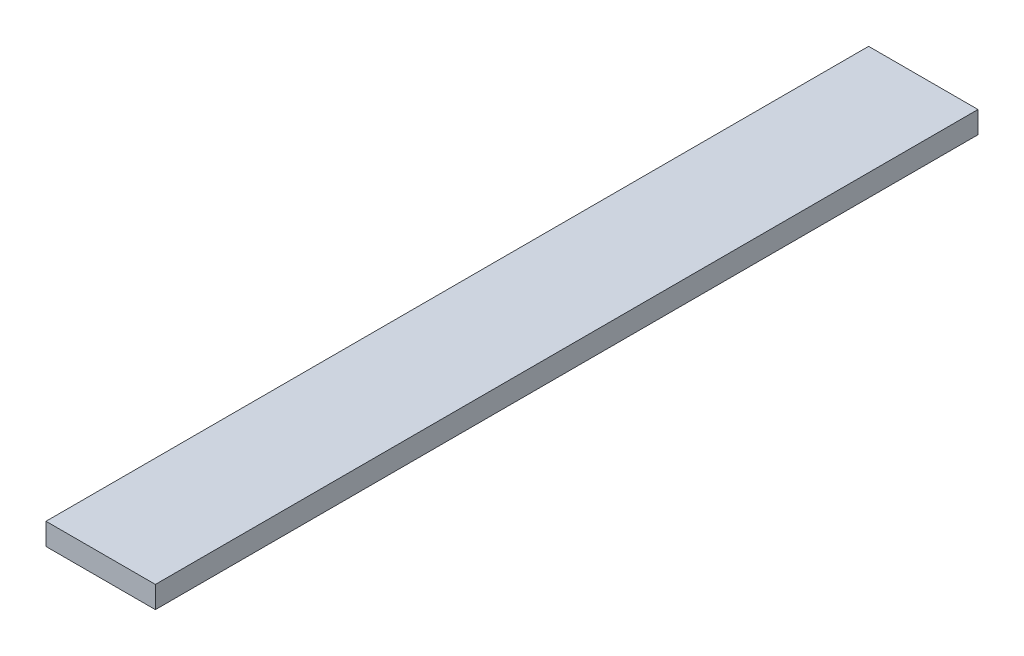
ISO-10303-21;
HEADER;
FILE_DESCRIPTION(('STEP AP214'),'2;1');
FILE_NAME('part.step','',(''),(''),'','','');
FILE_SCHEMA(('AUTOMOTIVE_DESIGN { 1 0 10303 214 1 1 1 1 }'));
ENDSEC;
DATA;
#1=APPLICATION_CONTEXT('core data for automotive mechanical design processes');
#2=APPLICATION_PROTOCOL_DEFINITION('international standard','automotive_design',2000,#1);
#3=PRODUCT_CONTEXT('',#1,'mechanical');
#4=PRODUCT('Part','Part','',(#3));
#5=PRODUCT_RELATED_PRODUCT_CATEGORY('part','',(#4));
#6=PRODUCT_DEFINITION_FORMATION('','',#4);
#7=PRODUCT_DEFINITION_CONTEXT('part definition',#1,'design');
#8=PRODUCT_DEFINITION('design','',#6,#7);
#9=PRODUCT_DEFINITION_SHAPE('','',#8);
#10=(LENGTH_UNIT() NAMED_UNIT(*) SI_UNIT(.MILLI.,.METRE.));
#11=(NAMED_UNIT(*) PLANE_ANGLE_UNIT() SI_UNIT($,.RADIAN.));
#12=(NAMED_UNIT(*) SI_UNIT($,.STERADIAN.) SOLID_ANGLE_UNIT());
#13=UNCERTAINTY_MEASURE_WITH_UNIT(LENGTH_MEASURE(1.E-05),#10,'distance_accuracy_value','');
#14=(GEOMETRIC_REPRESENTATION_CONTEXT(3) GLOBAL_UNCERTAINTY_ASSIGNED_CONTEXT((#13)) GLOBAL_UNIT_ASSIGNED_CONTEXT((#10,
#11,#12)) REPRESENTATION_CONTEXT('',''));
#15=CARTESIAN_POINT('',(0.,0.,0.));
#16=DIRECTION('',(0.,0.,1.));
#17=DIRECTION('',(1.,0.,0.));
#18=AXIS2_PLACEMENT_3D('',#15,#16,#17);
#19=CARTESIAN_POINT('',(0.,2.02999999999,0.));
#20=DIRECTION('',(0.,1.,0.));
#21=DIRECTION('',(-1.,0.,0.));
#22=AXIS2_PLACEMENT_3D('',#19,#20,#21);
#23=PLANE('',#22);
#24=DIRECTION('',(0.,0.,1.));
#25=VECTOR('',#24,1.);
#26=CARTESIAN_POINT('',(0.375,2.02999999999,0.195));
#27=LINE('',#26,#25);
#28=CARTESIAN_POINT('',(0.375,2.02999999999,0.195));
#29=VERTEX_POINT('',#28);
#30=CARTESIAN_POINT('',(0.375,2.02999999999,2.075));
#31=VERTEX_POINT('',#30);
#32=EDGE_CURVE('E80',#29,#31,#27,.T.);
#33=ORIENTED_EDGE('',*,*,#32,.T.);
#34=DIRECTION('',(-1.,0.,0.));
#35=VECTOR('',#34,1.);
#36=CARTESIAN_POINT('',(0.375,2.02999999999,2.075));
#37=LINE('',#36,#35);
#38=CARTESIAN_POINT('',(0.125,2.02999999999,2.075));
#39=VERTEX_POINT('',#38);
#40=EDGE_CURVE('E67',#31,#39,#37,.T.);
#41=ORIENTED_EDGE('',*,*,#40,.T.);
#42=DIRECTION('',(0.,0.,1.));
#43=VECTOR('',#42,1.);
#44=CARTESIAN_POINT('',(0.125,2.02999999999,0.195));
#45=LINE('',#44,#43);
#46=CARTESIAN_POINT('',(0.125,2.02999999999,0.195));
#47=VERTEX_POINT('',#46);
#48=EDGE_CURVE('E54',#39,#47,#45,.F.);
#49=ORIENTED_EDGE('',*,*,#48,.T.);
#50=DIRECTION('',(1.,0.,0.));
#51=VECTOR('',#50,1.);
#52=CARTESIAN_POINT('',(0.375,2.02999999999,0.195));
#53=LINE('',#52,#51);
#54=EDGE_CURVE('E19',#47,#29,#53,.T.);
#55=ORIENTED_EDGE('',*,*,#54,.T.);
#56=EDGE_LOOP('',(#33,#41,#49,#55));
#57=FACE_BOUND('',#56,.T.);
#58=ADVANCED_FACE('F16',(#57),#23,.F.);
#59=CARTESIAN_POINT('',(0.375,2.07999999999,0.195));
#60=DIRECTION('',(0.,0.,1.));
#61=DIRECTION('',(1.,0.,0.));
#62=AXIS2_PLACEMENT_3D('',#59,#60,#61);
#63=PLANE('',#62);
#64=DIRECTION('',(0.,1.,0.));
#65=VECTOR('',#64,1.);
#66=CARTESIAN_POINT('',(0.125,2.07999999999,0.195));
#67=LINE('',#66,#65);
#68=CARTESIAN_POINT('',(0.125,2.07999999999,0.195));
#69=VERTEX_POINT('',#68);
#70=EDGE_CURVE('E60',#47,#69,#67,.T.);
#71=ORIENTED_EDGE('',*,*,#70,.T.);
#72=DIRECTION('',(-1.,0.,0.));
#73=VECTOR('',#72,1.);
#74=CARTESIAN_POINT('',(0.,2.07999999999,0.195));
#75=LINE('',#74,#73);
#76=CARTESIAN_POINT('',(0.375,2.07999999999,0.195));
#77=VERTEX_POINT('',#76);
#78=EDGE_CURVE('E82',#77,#69,#75,.T.);
#79=ORIENTED_EDGE('',*,*,#78,.F.);
#80=DIRECTION('',(0.,-1.,0.));
#81=VECTOR('',#80,1.);
#82=CARTESIAN_POINT('',(0.375,2.07999999999,0.195));
#83=LINE('',#82,#81);
#84=EDGE_CURVE('E63',#77,#29,#83,.T.);
#85=ORIENTED_EDGE('',*,*,#84,.T.);
#86=ORIENTED_EDGE('',*,*,#54,.F.);
#87=EDGE_LOOP('',(#71,#79,#85,#86));
#88=FACE_BOUND('',#87,.T.);
#89=ADVANCED_FACE('F59',(#88),#63,.F.);
#90=CARTESIAN_POINT('',(0.125,2.07999999999,0.195));
#91=DIRECTION('',(1.,0.,0.));
#92=DIRECTION('',(0.,1.,0.));
#93=AXIS2_PLACEMENT_3D('',#90,#91,#92);
#94=PLANE('',#93);
#95=DIRECTION('',(0.,1.,0.));
#96=VECTOR('',#95,1.);
#97=CARTESIAN_POINT('',(0.125,2.07999999999,2.075));
#98=LINE('',#97,#96);
#99=CARTESIAN_POINT('',(0.125,2.07999999999,2.075));
#100=VERTEX_POINT('',#99);
#101=EDGE_CURVE('E69',#39,#100,#98,.T.);
#102=ORIENTED_EDGE('',*,*,#101,.T.);
#103=DIRECTION('',(0.,0.,1.));
#104=VECTOR('',#103,1.);
#105=CARTESIAN_POINT('',(0.125,2.07999999999,0.));
#106=LINE('',#105,#104);
#107=EDGE_CURVE('E73',#69,#100,#106,.T.);
#108=ORIENTED_EDGE('',*,*,#107,.F.);
#109=ORIENTED_EDGE('',*,*,#70,.F.);
#110=ORIENTED_EDGE('',*,*,#48,.F.);
#111=EDGE_LOOP('',(#102,#108,#109,#110));
#112=FACE_BOUND('',#111,.T.);
#113=ADVANCED_FACE('F71',(#112),#94,.F.);
#114=CARTESIAN_POINT('',(0.375,2.07999999999,2.075));
#115=DIRECTION('',(0.,0.,-1.));
#116=DIRECTION('',(-1.,0.,0.));
#117=AXIS2_PLACEMENT_3D('',#114,#115,#116);
#118=PLANE('',#117);
#119=DIRECTION('',(0.,-1.,0.));
#120=VECTOR('',#119,1.);
#121=CARTESIAN_POINT('',(0.375,2.07999999999,2.075));
#122=LINE('',#121,#120);
#123=CARTESIAN_POINT('',(0.375,2.07999999999,2.075));
#124=VERTEX_POINT('',#123);
#125=EDGE_CURVE('E34',#31,#124,#122,.F.);
#126=ORIENTED_EDGE('',*,*,#125,.T.);
#127=DIRECTION('',(-1.,0.,0.));
#128=VECTOR('',#127,1.);
#129=CARTESIAN_POINT('',(0.,2.07999999999,2.075));
#130=LINE('',#129,#128);
#131=EDGE_CURVE('E25',#100,#124,#130,.F.);
#132=ORIENTED_EDGE('',*,*,#131,.F.);
#133=ORIENTED_EDGE('',*,*,#101,.F.);
#134=ORIENTED_EDGE('',*,*,#40,.F.);
#135=EDGE_LOOP('',(#126,#132,#133,#134));
#136=FACE_BOUND('',#135,.T.);
#137=ADVANCED_FACE('F88',(#136),#118,.F.);
#138=CARTESIAN_POINT('',(0.375,2.07999999999,0.195));
#139=DIRECTION('',(-1.,0.,0.));
#140=DIRECTION('',(0.,-1.,0.));
#141=AXIS2_PLACEMENT_3D('',#138,#139,#140);
#142=PLANE('',#141);
#143=ORIENTED_EDGE('',*,*,#84,.F.);
#144=DIRECTION('',(0.,0.,1.));
#145=VECTOR('',#144,1.);
#146=CARTESIAN_POINT('',(0.375,2.07999999999,0.));
#147=LINE('',#146,#145);
#148=EDGE_CURVE('E11',#124,#77,#147,.F.);
#149=ORIENTED_EDGE('',*,*,#148,.F.);
#150=ORIENTED_EDGE('',*,*,#125,.F.);
#151=ORIENTED_EDGE('',*,*,#32,.F.);
#152=EDGE_LOOP('',(#143,#149,#150,#151));
#153=FACE_BOUND('',#152,.T.);
#154=ADVANCED_FACE('F90',(#153),#142,.F.);
#155=CARTESIAN_POINT('',(0.,2.07999999999,0.));
#156=DIRECTION('',(0.,1.,0.));
#157=DIRECTION('',(-1.,0.,0.));
#158=AXIS2_PLACEMENT_3D('',#155,#156,#157);
#159=PLANE('',#158);
#160=ORIENTED_EDGE('',*,*,#131,.T.);
#161=ORIENTED_EDGE('',*,*,#148,.T.);
#162=ORIENTED_EDGE('',*,*,#78,.T.);
#163=ORIENTED_EDGE('',*,*,#107,.T.);
#164=EDGE_LOOP('',(#160,#161,#162,#163));
#165=FACE_BOUND('',#164,.T.);
#166=ADVANCED_FACE('F87',(#165),#159,.T.);
#167=CLOSED_SHELL('',(#58,#89,#113,#137,#154,#166));
#168=MANIFOLD_SOLID_BREP('B1',#167);
#169=ADVANCED_BREP_SHAPE_REPRESENTATION('',(#18,#168),#14);
#170=SHAPE_DEFINITION_REPRESENTATION(#9,#169);
ENDSEC;
END-ISO-10303-21;
